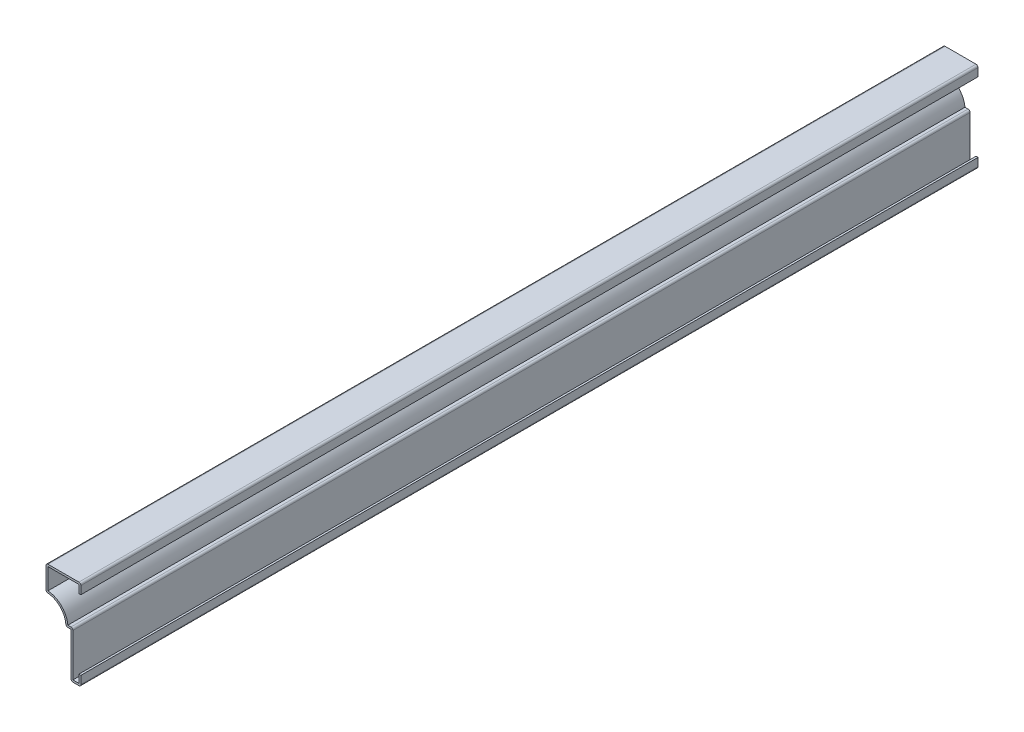
ISO-10303-21;
HEADER;
FILE_DESCRIPTION(('STEP AP214'),'2;1');
FILE_NAME('part.step','',(''),(''),'','','');
FILE_SCHEMA(('AUTOMOTIVE_DESIGN { 1 0 10303 214 1 1 1 1 }'));
ENDSEC;
DATA;
#1=APPLICATION_CONTEXT('core data for automotive mechanical design processes');
#2=APPLICATION_PROTOCOL_DEFINITION('international standard','automotive_design',2000,#1);
#3=PRODUCT_CONTEXT('',#1,'mechanical');
#4=PRODUCT('Part','Part','',(#3));
#5=PRODUCT_RELATED_PRODUCT_CATEGORY('part','',(#4));
#6=PRODUCT_DEFINITION_FORMATION('','',#4);
#7=PRODUCT_DEFINITION_CONTEXT('part definition',#1,'design');
#8=PRODUCT_DEFINITION('design','',#6,#7);
#9=PRODUCT_DEFINITION_SHAPE('','',#8);
#10=(LENGTH_UNIT() NAMED_UNIT(*) SI_UNIT(.MILLI.,.METRE.));
#11=(NAMED_UNIT(*) PLANE_ANGLE_UNIT() SI_UNIT($,.RADIAN.));
#12=(NAMED_UNIT(*) SI_UNIT($,.STERADIAN.) SOLID_ANGLE_UNIT());
#13=UNCERTAINTY_MEASURE_WITH_UNIT(LENGTH_MEASURE(1.E-05),#10,'distance_accuracy_value','');
#14=(GEOMETRIC_REPRESENTATION_CONTEXT(3) GLOBAL_UNCERTAINTY_ASSIGNED_CONTEXT((#13)) GLOBAL_UNIT_ASSIGNED_CONTEXT((#10,
#11,#12)) REPRESENTATION_CONTEXT('',''));
#15=CARTESIAN_POINT('',(0.,0.,0.));
#16=DIRECTION('',(0.,0.,1.));
#17=DIRECTION('',(1.,0.,0.));
#18=AXIS2_PLACEMENT_3D('',#15,#16,#17);
#19=CARTESIAN_POINT('',(-1.27,57.15,-571.5));
#20=DIRECTION('',(-1.,0.,0.));
#21=DIRECTION('',(0.,-1.,0.));
#22=AXIS2_PLACEMENT_3D('',#19,#20,#21);
#23=PLANE('',#22);
#24=DIRECTION('',(0.,-1.,0.));
#25=VECTOR('',#24,1.);
#26=CARTESIAN_POINT('',(-1.27,57.15,0.));
#27=LINE('',#26,#25);
#28=CARTESIAN_POINT('',(-1.27,55.88,0.));
#29=VERTEX_POINT('',#28);
#30=CARTESIAN_POINT('',(-1.27,50.8,0.));
#31=VERTEX_POINT('',#30);
#32=EDGE_CURVE('E273',#29,#31,#27,.T.);
#33=ORIENTED_EDGE('',*,*,#32,.F.);
#34=DIRECTION('',(0.,0.,1.));
#35=VECTOR('',#34,1.);
#36=CARTESIAN_POINT('',(-1.27,55.88,-571.5));
#37=LINE('',#36,#35);
#38=CARTESIAN_POINT('',(-1.27,55.88,-571.5));
#39=VERTEX_POINT('',#38);
#40=EDGE_CURVE('E227',#39,#29,#37,.T.);
#41=ORIENTED_EDGE('',*,*,#40,.F.);
#42=DIRECTION('',(0.,-1.,0.));
#43=VECTOR('',#42,1.);
#44=CARTESIAN_POINT('',(-1.27,57.15,-571.5));
#45=LINE('',#44,#43);
#46=CARTESIAN_POINT('',(-1.27,50.8,-571.5));
#47=VERTEX_POINT('',#46);
#48=EDGE_CURVE('E209',#39,#47,#45,.T.);
#49=ORIENTED_EDGE('',*,*,#48,.T.);
#50=DIRECTION('',(0.,0.,1.));
#51=VECTOR('',#50,1.);
#52=CARTESIAN_POINT('',(-1.27,50.8,-571.5));
#53=LINE('',#52,#51);
#54=EDGE_CURVE('E217',#47,#31,#53,.T.);
#55=ORIENTED_EDGE('',*,*,#54,.T.);
#56=EDGE_LOOP('',(#33,#41,#49,#55));
#57=FACE_BOUND('',#56,.T.);
#58=ADVANCED_FACE('F35',(#57),#23,.T.);
#59=CARTESIAN_POINT('',(-22.225,55.88,-571.5));
#60=DIRECTION('',(0.,-1.,0.));
#61=DIRECTION('',(0.,0.,-1.));
#62=AXIS2_PLACEMENT_3D('',#59,#60,#61);
#63=PLANE('',#62);
#64=DIRECTION('',(1.,0.,0.));
#65=VECTOR('',#64,1.);
#66=CARTESIAN_POINT('',(-22.225,55.88,0.));
#67=LINE('',#66,#65);
#68=CARTESIAN_POINT('',(-20.955,55.88,0.));
#69=VERTEX_POINT('',#68);
#70=EDGE_CURVE('E228',#69,#29,#67,.T.);
#71=ORIENTED_EDGE('',*,*,#70,.F.);
#72=DIRECTION('',(0.,0.,1.));
#73=VECTOR('',#72,1.);
#74=CARTESIAN_POINT('',(-20.955,55.88,-571.5));
#75=LINE('',#74,#73);
#76=CARTESIAN_POINT('',(-20.955,55.88,-571.5));
#77=VERTEX_POINT('',#76);
#78=EDGE_CURVE('E317',#77,#69,#75,.T.);
#79=ORIENTED_EDGE('',*,*,#78,.F.);
#80=DIRECTION('',(1.,0.,0.));
#81=VECTOR('',#80,1.);
#82=CARTESIAN_POINT('',(-22.225,55.88,-571.5));
#83=LINE('',#82,#81);
#84=EDGE_CURVE('E225',#77,#39,#83,.T.);
#85=ORIENTED_EDGE('',*,*,#84,.T.);
#86=ORIENTED_EDGE('',*,*,#40,.T.);
#87=EDGE_LOOP('',(#71,#79,#85,#86));
#88=FACE_BOUND('',#87,.T.);
#89=ADVANCED_FACE('F408',(#88),#63,.T.);
#90=CARTESIAN_POINT('',(-20.955,41.275,-571.5));
#91=DIRECTION('',(1.,0.,0.));
#92=DIRECTION('',(0.,0.,-1.));
#93=AXIS2_PLACEMENT_3D('',#90,#91,#92);
#94=PLANE('',#93);
#95=DIRECTION('',(0.,1.,0.));
#96=VECTOR('',#95,1.);
#97=CARTESIAN_POINT('',(-20.955,41.275,0.));
#98=LINE('',#97,#96);
#99=CARTESIAN_POINT('',(-20.955,42.4871529606312,0.));
#100=VERTEX_POINT('',#99);
#101=EDGE_CURVE('E231',#100,#69,#98,.T.);
#102=ORIENTED_EDGE('',*,*,#101,.F.);
#103=DIRECTION('',(0.,0.,1.));
#104=VECTOR('',#103,1.);
#105=CARTESIAN_POINT('',(-20.955,42.4871529606312,-571.5));
#106=LINE('',#105,#104);
#107=CARTESIAN_POINT('',(-20.955,42.4871529606312,-571.5));
#108=VERTEX_POINT('',#107);
#109=EDGE_CURVE('E319',#108,#100,#106,.T.);
#110=ORIENTED_EDGE('',*,*,#109,.F.);
#111=DIRECTION('',(0.,1.,0.));
#112=VECTOR('',#111,1.);
#113=CARTESIAN_POINT('',(-20.955,41.275,-571.5));
#114=LINE('',#113,#112);
#115=EDGE_CURVE('E269',#108,#77,#114,.T.);
#116=ORIENTED_EDGE('',*,*,#115,.T.);
#117=ORIENTED_EDGE('',*,*,#78,.T.);
#118=EDGE_LOOP('',(#102,#110,#116,#117));
#119=FACE_BOUND('',#118,.T.);
#120=ADVANCED_FACE('F496',(#119),#94,.T.);
#121=CARTESIAN_POINT('',(-22.225,28.575,-571.5));
#122=DIRECTION('',(0.,0.,1.));
#123=DIRECTION('',(1.,0.,0.));
#124=AXIS2_PLACEMENT_3D('',#121,#122,#123);
#125=CYLINDRICAL_SURFACE('',#124,13.97);
#126=CARTESIAN_POINT('',(-22.225,28.575,0.));
#127=DIRECTION('',(0.,0.,1.));
#128=DIRECTION('',(1.,0.,0.));
#129=AXIS2_PLACEMENT_3D('',#126,#127,#128);
#130=CIRCLE('',#129,13.97);
#131=CARTESIAN_POINT('',(-8.31284703936878,29.845,0.));
#132=VERTEX_POINT('',#131);
#133=EDGE_CURVE('E310',#132,#100,#130,.T.);
#134=ORIENTED_EDGE('',*,*,#133,.F.);
#135=DIRECTION('',(0.,0.,1.));
#136=VECTOR('',#135,1.);
#137=CARTESIAN_POINT('',(-8.31284703936878,29.845,-571.5));
#138=LINE('',#137,#136);
#139=CARTESIAN_POINT('',(-8.31284703936878,29.845,-571.5));
#140=VERTEX_POINT('',#139);
#141=EDGE_CURVE('E321',#140,#132,#138,.T.);
#142=ORIENTED_EDGE('',*,*,#141,.F.);
#143=CARTESIAN_POINT('',(-22.225,28.575,-571.5));
#144=DIRECTION('',(0.,0.,1.));
#145=DIRECTION('',(1.,0.,0.));
#146=AXIS2_PLACEMENT_3D('',#143,#144,#145);
#147=CIRCLE('',#146,13.97);
#148=EDGE_CURVE('E266',#140,#108,#147,.T.);
#149=ORIENTED_EDGE('',*,*,#148,.T.);
#150=ORIENTED_EDGE('',*,*,#109,.T.);
#151=EDGE_LOOP('',(#134,#142,#149,#150));
#152=FACE_BOUND('',#151,.T.);
#153=ADVANCED_FACE('F416',(#152),#125,.T.);
#154=CARTESIAN_POINT('',(-6.35,29.845,-571.5));
#155=DIRECTION('',(0.,1.,0.));
#156=DIRECTION('',(0.,0.,1.));
#157=AXIS2_PLACEMENT_3D('',#154,#155,#156);
#158=PLANE('',#157);
#159=DIRECTION('',(1.,0.,0.));
#160=VECTOR('',#159,1.);
#161=CARTESIAN_POINT('',(-6.35,29.845,0.));
#162=LINE('',#161,#160);
#163=CARTESIAN_POINT('',(-6.35,29.845,0.));
#164=VERTEX_POINT('',#163);
#165=EDGE_CURVE('E308',#164,#132,#162,.F.);
#166=ORIENTED_EDGE('',*,*,#165,.F.);
#167=DIRECTION('',(0.,0.,1.));
#168=VECTOR('',#167,1.);
#169=CARTESIAN_POINT('',(-6.35,29.845,-571.5));
#170=LINE('',#169,#168);
#171=CARTESIAN_POINT('',(-6.35,29.845,-571.5));
#172=VERTEX_POINT('',#171);
#173=EDGE_CURVE('E376',#164,#172,#170,.F.);
#174=ORIENTED_EDGE('',*,*,#173,.T.);
#175=DIRECTION('',(1.,0.,0.));
#176=VECTOR('',#175,1.);
#177=CARTESIAN_POINT('',(-6.35,29.845,-571.5));
#178=LINE('',#177,#176);
#179=EDGE_CURVE('E264',#172,#140,#178,.F.);
#180=ORIENTED_EDGE('',*,*,#179,.T.);
#181=ORIENTED_EDGE('',*,*,#141,.T.);
#182=EDGE_LOOP('',(#166,#174,#180,#181));
#183=FACE_BOUND('',#182,.T.);
#184=ADVANCED_FACE('F419',(#183),#158,.T.);
#185=CARTESIAN_POINT('',(-5.08,0.,-571.5));
#186=DIRECTION('',(1.,0.,0.));
#187=DIRECTION('',(0.,0.,-1.));
#188=AXIS2_PLACEMENT_3D('',#185,#186,#187);
#189=PLANE('',#188);
#190=DIRECTION('',(0.,1.,0.));
#191=VECTOR('',#190,1.);
#192=CARTESIAN_POINT('',(-5.08,0.,-571.5));
#193=LINE('',#192,#191);
#194=CARTESIAN_POINT('',(-5.08,1.27,-571.5));
#195=VERTEX_POINT('',#194);
#196=CARTESIAN_POINT('',(-5.08,28.575,-571.5));
#197=VERTEX_POINT('',#196);
#198=EDGE_CURVE('E261',#195,#197,#193,.T.);
#199=ORIENTED_EDGE('',*,*,#198,.T.);
#200=DIRECTION('',(0.,0.,1.));
#201=VECTOR('',#200,1.);
#202=CARTESIAN_POINT('',(-5.08,28.575,-571.5));
#203=LINE('',#202,#201);
#204=CARTESIAN_POINT('',(-5.08,28.575,0.));
#205=VERTEX_POINT('',#204);
#206=EDGE_CURVE('E373',#197,#205,#203,.T.);
#207=ORIENTED_EDGE('',*,*,#206,.T.);
#208=DIRECTION('',(0.,1.,0.));
#209=VECTOR('',#208,1.);
#210=CARTESIAN_POINT('',(-5.08,0.,0.));
#211=LINE('',#210,#209);
#212=CARTESIAN_POINT('',(-5.08,1.27,0.));
#213=VERTEX_POINT('',#212);
#214=EDGE_CURVE('E305',#213,#205,#211,.T.);
#215=ORIENTED_EDGE('',*,*,#214,.F.);
#216=DIRECTION('',(0.,0.,1.));
#217=VECTOR('',#216,1.);
#218=CARTESIAN_POINT('',(-5.08,1.27,-571.5));
#219=LINE('',#218,#217);
#220=EDGE_CURVE('E324',#195,#213,#219,.T.);
#221=ORIENTED_EDGE('',*,*,#220,.F.);
#222=EDGE_LOOP('',(#199,#207,#215,#221));
#223=FACE_BOUND('',#222,.T.);
#224=ADVANCED_FACE('F428',(#223),#189,.T.);
#225=CARTESIAN_POINT('',(0.,1.27,-571.5));
#226=DIRECTION('',(0.,1.,0.));
#227=DIRECTION('',(-1.,0.,0.));
#228=AXIS2_PLACEMENT_3D('',#225,#226,#227);
#229=PLANE('',#228);
#230=DIRECTION('',(-1.,0.,0.));
#231=VECTOR('',#230,1.);
#232=CARTESIAN_POINT('',(0.,1.27,0.));
#233=LINE('',#232,#231);
#234=CARTESIAN_POINT('',(-1.27,1.27,0.));
#235=VERTEX_POINT('',#234);
#236=EDGE_CURVE('E302',#235,#213,#233,.T.);
#237=ORIENTED_EDGE('',*,*,#236,.F.);
#238=DIRECTION('',(0.,0.,1.));
#239=VECTOR('',#238,1.);
#240=CARTESIAN_POINT('',(-1.27,1.27,-571.5));
#241=LINE('',#240,#239);
#242=CARTESIAN_POINT('',(-1.27,1.27,-571.5));
#243=VERTEX_POINT('',#242);
#244=EDGE_CURVE('E326',#243,#235,#241,.T.);
#245=ORIENTED_EDGE('',*,*,#244,.F.);
#246=DIRECTION('',(-1.,0.,0.));
#247=VECTOR('',#246,1.);
#248=CARTESIAN_POINT('',(0.,1.27,-571.5));
#249=LINE('',#248,#247);
#250=EDGE_CURVE('E258',#243,#195,#249,.T.);
#251=ORIENTED_EDGE('',*,*,#250,.T.);
#252=ORIENTED_EDGE('',*,*,#220,.T.);
#253=EDGE_LOOP('',(#237,#245,#251,#252));
#254=FACE_BOUND('',#253,.T.);
#255=ADVANCED_FACE('F433',(#254),#229,.T.);
#256=CARTESIAN_POINT('',(-1.27,6.35,-571.5));
#257=DIRECTION('',(-1.,0.,0.));
#258=DIRECTION('',(0.,0.,1.));
#259=AXIS2_PLACEMENT_3D('',#256,#257,#258);
#260=PLANE('',#259);
#261=DIRECTION('',(0.,1.,0.));
#262=VECTOR('',#261,1.);
#263=CARTESIAN_POINT('',(-1.27,6.35,0.));
#264=LINE('',#263,#262);
#265=CARTESIAN_POINT('',(-1.27,6.35,0.));
#266=VERTEX_POINT('',#265);
#267=EDGE_CURVE('E299',#266,#235,#264,.F.);
#268=ORIENTED_EDGE('',*,*,#267,.F.);
#269=DIRECTION('',(0.,0.,1.));
#270=VECTOR('',#269,1.);
#271=CARTESIAN_POINT('',(-1.27,6.35,-571.5));
#272=LINE('',#271,#270);
#273=CARTESIAN_POINT('',(-1.27,6.35,-571.5));
#274=VERTEX_POINT('',#273);
#275=EDGE_CURVE('E328',#274,#266,#272,.T.);
#276=ORIENTED_EDGE('',*,*,#275,.F.);
#277=DIRECTION('',(0.,1.,0.));
#278=VECTOR('',#277,1.);
#279=CARTESIAN_POINT('',(-1.27,6.35,-571.5));
#280=LINE('',#279,#278);
#281=EDGE_CURVE('E255',#274,#243,#280,.F.);
#282=ORIENTED_EDGE('',*,*,#281,.T.);
#283=ORIENTED_EDGE('',*,*,#244,.T.);
#284=EDGE_LOOP('',(#268,#276,#282,#283));
#285=FACE_BOUND('',#284,.T.);
#286=ADVANCED_FACE('F437',(#285),#260,.T.);
#287=CARTESIAN_POINT('',(-1.27,6.35,-571.5));
#288=DIRECTION('',(0.,-1.,0.));
#289=DIRECTION('',(0.,0.,-1.));
#290=AXIS2_PLACEMENT_3D('',#287,#288,#289);
#291=PLANE('',#290);
#292=DIRECTION('',(1.,0.,0.));
#293=VECTOR('',#292,1.);
#294=CARTESIAN_POINT('',(-1.27,6.35,0.));
#295=LINE('',#294,#293);
#296=CARTESIAN_POINT('',(0.,6.35,0.));
#297=VERTEX_POINT('',#296);
#298=EDGE_CURVE('E297',#266,#297,#295,.T.);
#299=ORIENTED_EDGE('',*,*,#298,.T.);
#300=DIRECTION('',(0.,0.,1.));
#301=VECTOR('',#300,1.);
#302=CARTESIAN_POINT('',(0.,6.35,-571.5));
#303=LINE('',#302,#301);
#304=CARTESIAN_POINT('',(0.,6.35,-571.5));
#305=VERTEX_POINT('',#304);
#306=EDGE_CURVE('E330',#305,#297,#303,.T.);
#307=ORIENTED_EDGE('',*,*,#306,.F.);
#308=DIRECTION('',(1.,0.,0.));
#309=VECTOR('',#308,1.);
#310=CARTESIAN_POINT('',(-1.27,6.35,-571.5));
#311=LINE('',#310,#309);
#312=EDGE_CURVE('E253',#274,#305,#311,.T.);
#313=ORIENTED_EDGE('',*,*,#312,.F.);
#314=ORIENTED_EDGE('',*,*,#275,.T.);
#315=EDGE_LOOP('',(#299,#307,#313,#314));
#316=FACE_BOUND('',#315,.T.);
#317=ADVANCED_FACE('F441',(#316),#291,.F.);
#318=CARTESIAN_POINT('',(0.,6.35,-571.5));
#319=DIRECTION('',(-1.,0.,0.));
#320=DIRECTION('',(0.,0.,1.));
#321=AXIS2_PLACEMENT_3D('',#318,#319,#320);
#322=PLANE('',#321);
#323=DIRECTION('',(0.,-1.,0.));
#324=VECTOR('',#323,1.);
#325=CARTESIAN_POINT('',(0.,6.35,0.));
#326=LINE('',#325,#324);
#327=CARTESIAN_POINT('',(0.,1.27,0.));
#328=VERTEX_POINT('',#327);
#329=EDGE_CURVE('E294',#297,#328,#326,.T.);
#330=ORIENTED_EDGE('',*,*,#329,.T.);
#331=DIRECTION('',(0.,0.,1.));
#332=VECTOR('',#331,1.);
#333=CARTESIAN_POINT('',(0.,1.27,-571.5));
#334=LINE('',#333,#332);
#335=CARTESIAN_POINT('',(0.,1.27,-571.5));
#336=VERTEX_POINT('',#335);
#337=EDGE_CURVE('E355',#328,#336,#334,.F.);
#338=ORIENTED_EDGE('',*,*,#337,.T.);
#339=DIRECTION('',(0.,-1.,0.));
#340=VECTOR('',#339,1.);
#341=CARTESIAN_POINT('',(0.,6.35,-571.5));
#342=LINE('',#341,#340);
#343=EDGE_CURVE('E251',#305,#336,#342,.T.);
#344=ORIENTED_EDGE('',*,*,#343,.F.);
#345=ORIENTED_EDGE('',*,*,#306,.T.);
#346=EDGE_LOOP('',(#330,#338,#344,#345));
#347=FACE_BOUND('',#346,.T.);
#348=ADVANCED_FACE('F617',(#347),#322,.F.);
#349=CARTESIAN_POINT('',(0.,0.,-571.5));
#350=DIRECTION('',(0.,1.,0.));
#351=DIRECTION('',(-1.,0.,0.));
#352=AXIS2_PLACEMENT_3D('',#349,#350,#351);
#353=PLANE('',#352);
#354=DIRECTION('',(-1.,0.,0.));
#355=VECTOR('',#354,1.);
#356=CARTESIAN_POINT('',(0.,0.,-571.5));
#357=LINE('',#356,#355);
#358=CARTESIAN_POINT('',(-1.27,0.,-571.5));
#359=VERTEX_POINT('',#358);
#360=CARTESIAN_POINT('',(-5.08,0.,-571.5));
#361=VERTEX_POINT('',#360);
#362=EDGE_CURVE('E248',#359,#361,#357,.T.);
#363=ORIENTED_EDGE('',*,*,#362,.F.);
#364=DIRECTION('',(0.,0.,1.));
#365=VECTOR('',#364,1.);
#366=CARTESIAN_POINT('',(-1.27,0.,-571.5));
#367=LINE('',#366,#365);
#368=CARTESIAN_POINT('',(-1.27,0.,0.));
#369=VERTEX_POINT('',#368);
#370=EDGE_CURVE('E338',#359,#369,#367,.T.);
#371=ORIENTED_EDGE('',*,*,#370,.T.);
#372=DIRECTION('',(-1.,0.,0.));
#373=VECTOR('',#372,1.);
#374=CARTESIAN_POINT('',(0.,0.,0.));
#375=LINE('',#374,#373);
#376=CARTESIAN_POINT('',(-5.08,0.,0.));
#377=VERTEX_POINT('',#376);
#378=EDGE_CURVE('E291',#369,#377,#375,.T.);
#379=ORIENTED_EDGE('',*,*,#378,.T.);
#380=DIRECTION('',(0.,0.,1.));
#381=VECTOR('',#380,1.);
#382=CARTESIAN_POINT('',(-5.08,0.,-571.5));
#383=LINE('',#382,#381);
#384=EDGE_CURVE('E316',#377,#361,#383,.F.);
#385=ORIENTED_EDGE('',*,*,#384,.T.);
#386=EDGE_LOOP('',(#363,#371,#379,#385));
#387=FACE_BOUND('',#386,.T.);
#388=ADVANCED_FACE('F451',(#387),#353,.F.);
#389=CARTESIAN_POINT('',(-6.35,0.,-571.5));
#390=DIRECTION('',(1.,0.,0.));
#391=DIRECTION('',(0.,0.,-1.));
#392=AXIS2_PLACEMENT_3D('',#389,#390,#391);
#393=PLANE('',#392);
#394=DIRECTION('',(0.,1.,0.));
#395=VECTOR('',#394,1.);
#396=CARTESIAN_POINT('',(-6.35,0.,-571.5));
#397=LINE('',#396,#395);
#398=CARTESIAN_POINT('',(-6.35,1.27,-571.5));
#399=VERTEX_POINT('',#398);
#400=CARTESIAN_POINT('',(-6.35,28.575,-571.5));
#401=VERTEX_POINT('',#400);
#402=EDGE_CURVE('E246',#399,#401,#397,.T.);
#403=ORIENTED_EDGE('',*,*,#402,.F.);
#404=DIRECTION('',(0.,0.,1.));
#405=VECTOR('',#404,1.);
#406=CARTESIAN_POINT('',(-6.35,1.27,-571.5));
#407=LINE('',#406,#405);
#408=CARTESIAN_POINT('',(-6.35,1.27,0.));
#409=VERTEX_POINT('',#408);
#410=EDGE_CURVE('E370',#399,#409,#407,.T.);
#411=ORIENTED_EDGE('',*,*,#410,.T.);
#412=DIRECTION('',(0.,1.,0.));
#413=VECTOR('',#412,1.);
#414=CARTESIAN_POINT('',(-6.35,0.,0.));
#415=LINE('',#414,#413);
#416=CARTESIAN_POINT('',(-6.35,28.575,0.));
#417=VERTEX_POINT('',#416);
#418=EDGE_CURVE('E289',#409,#417,#415,.T.);
#419=ORIENTED_EDGE('',*,*,#418,.T.);
#420=DIRECTION('',(0.,0.,1.));
#421=VECTOR('',#420,1.);
#422=CARTESIAN_POINT('',(-6.35,28.575,-571.5));
#423=LINE('',#422,#421);
#424=EDGE_CURVE('E333',#401,#417,#423,.T.);
#425=ORIENTED_EDGE('',*,*,#424,.F.);
#426=EDGE_LOOP('',(#403,#411,#419,#425));
#427=FACE_BOUND('',#426,.T.);
#428=ADVANCED_FACE('F462',(#427),#393,.F.);
#429=CARTESIAN_POINT('',(-6.35,28.575,-571.5));
#430=DIRECTION('',(0.,1.,0.));
#431=DIRECTION('',(0.,0.,1.));
#432=AXIS2_PLACEMENT_3D('',#429,#430,#431);
#433=PLANE('',#432);
#434=DIRECTION('',(-1.,0.,0.));
#435=VECTOR('',#434,1.);
#436=CARTESIAN_POINT('',(-6.35,28.575,0.));
#437=LINE('',#436,#435);
#438=CARTESIAN_POINT('',(-8.31284703936878,28.575,0.));
#439=VERTEX_POINT('',#438);
#440=EDGE_CURVE('E286',#417,#439,#437,.T.);
#441=ORIENTED_EDGE('',*,*,#440,.T.);
#442=DIRECTION('',(0.,0.,1.));
#443=VECTOR('',#442,1.);
#444=CARTESIAN_POINT('',(-8.31284703936878,28.575,-571.5));
#445=LINE('',#444,#443);
#446=CARTESIAN_POINT('',(-8.31284703936878,28.575,-571.5));
#447=VERTEX_POINT('',#446);
#448=EDGE_CURVE('E383',#439,#447,#445,.F.);
#449=ORIENTED_EDGE('',*,*,#448,.T.);
#450=DIRECTION('',(-1.,0.,0.));
#451=VECTOR('',#450,1.);
#452=CARTESIAN_POINT('',(-6.35,28.575,-571.5));
#453=LINE('',#452,#451);
#454=EDGE_CURVE('E243',#401,#447,#453,.T.);
#455=ORIENTED_EDGE('',*,*,#454,.F.);
#456=ORIENTED_EDGE('',*,*,#424,.T.);
#457=EDGE_LOOP('',(#441,#449,#455,#456));
#458=FACE_BOUND('',#457,.T.);
#459=ADVANCED_FACE('F595',(#458),#433,.F.);
#460=CARTESIAN_POINT('',(-22.225,28.575,-571.5));
#461=DIRECTION('',(0.,0.,1.));
#462=DIRECTION('',(1.,0.,0.));
#463=AXIS2_PLACEMENT_3D('',#460,#461,#462);
#464=CYLINDRICAL_SURFACE('',#463,12.7);
#465=CARTESIAN_POINT('',(-22.225,28.575,-571.5));
#466=DIRECTION('',(0.,0.,1.));
#467=DIRECTION('',(1.,0.,0.));
#468=AXIS2_PLACEMENT_3D('',#465,#466,#467);
#469=CIRCLE('',#468,12.7);
#470=CARTESIAN_POINT('',(-9.57758821760798,29.7295454545454,-571.5));
#471=VERTEX_POINT('',#470);
#472=CARTESIAN_POINT('',(-21.0704545454545,41.222411782392,-571.5));
#473=VERTEX_POINT('',#472);
#474=EDGE_CURVE('E240',#471,#473,#469,.T.);
#475=ORIENTED_EDGE('',*,*,#474,.F.);
#476=DIRECTION('',(0.,0.,1.));
#477=VECTOR('',#476,1.);
#478=CARTESIAN_POINT('',(-9.57758821760798,29.7295454545454,-571.5));
#479=LINE('',#478,#477);
#480=CARTESIAN_POINT('',(-9.57758821760798,29.7295454545454,0.));
#481=VERTEX_POINT('',#480);
#482=EDGE_CURVE('E380',#471,#481,#479,.T.);
#483=ORIENTED_EDGE('',*,*,#482,.T.);
#484=CARTESIAN_POINT('',(-22.225,28.575,0.));
#485=DIRECTION('',(0.,0.,1.));
#486=DIRECTION('',(1.,0.,0.));
#487=AXIS2_PLACEMENT_3D('',#484,#485,#486);
#488=CIRCLE('',#487,12.7);
#489=CARTESIAN_POINT('',(-21.0704545454545,41.222411782392,0.));
#490=VERTEX_POINT('',#489);
#491=EDGE_CURVE('E283',#481,#490,#488,.T.);
#492=ORIENTED_EDGE('',*,*,#491,.T.);
#493=DIRECTION('',(0.,0.,1.));
#494=VECTOR('',#493,1.);
#495=CARTESIAN_POINT('',(-21.0704545454545,41.222411782392,-571.5));
#496=LINE('',#495,#494);
#497=EDGE_CURVE('E378',#490,#473,#496,.F.);
#498=ORIENTED_EDGE('',*,*,#497,.T.);
#499=EDGE_LOOP('',(#475,#483,#492,#498));
#500=FACE_BOUND('',#499,.T.);
#501=ADVANCED_FACE('F474',(#500),#464,.F.);
#502=CARTESIAN_POINT('',(-22.225,41.275,-571.5));
#503=DIRECTION('',(1.,0.,0.));
#504=DIRECTION('',(0.,0.,-1.));
#505=AXIS2_PLACEMENT_3D('',#502,#503,#504);
#506=PLANE('',#505);
#507=DIRECTION('',(0.,1.,0.));
#508=VECTOR('',#507,1.);
#509=CARTESIAN_POINT('',(-22.225,41.275,-571.5));
#510=LINE('',#509,#508);
#511=CARTESIAN_POINT('',(-22.225,42.4871529606312,-571.5));
#512=VERTEX_POINT('',#511);
#513=CARTESIAN_POINT('',(-22.225,55.88,-571.5));
#514=VERTEX_POINT('',#513);
#515=EDGE_CURVE('E237',#512,#514,#510,.T.);
#516=ORIENTED_EDGE('',*,*,#515,.F.);
#517=DIRECTION('',(0.,0.,1.));
#518=VECTOR('',#517,1.);
#519=CARTESIAN_POINT('',(-22.225,42.4871529606312,-571.5));
#520=LINE('',#519,#518);
#521=CARTESIAN_POINT('',(-22.225,42.4871529606312,0.));
#522=VERTEX_POINT('',#521);
#523=EDGE_CURVE('E387',#512,#522,#520,.T.);
#524=ORIENTED_EDGE('',*,*,#523,.T.);
#525=DIRECTION('',(0.,1.,0.));
#526=VECTOR('',#525,1.);
#527=CARTESIAN_POINT('',(-22.225,41.275,0.));
#528=LINE('',#527,#526);
#529=CARTESIAN_POINT('',(-22.225,55.88,0.));
#530=VERTEX_POINT('',#529);
#531=EDGE_CURVE('E280',#522,#530,#528,.T.);
#532=ORIENTED_EDGE('',*,*,#531,.T.);
#533=DIRECTION('',(0.,0.,1.));
#534=VECTOR('',#533,1.);
#535=CARTESIAN_POINT('',(-22.225,55.88,-571.5));
#536=LINE('',#535,#534);
#537=EDGE_CURVE('E385',#530,#514,#536,.F.);
#538=ORIENTED_EDGE('',*,*,#537,.T.);
#539=EDGE_LOOP('',(#516,#524,#532,#538));
#540=FACE_BOUND('',#539,.T.);
#541=ADVANCED_FACE('F482',(#540),#506,.F.);
#542=CARTESIAN_POINT('',(-22.225,57.15,-571.5));
#543=DIRECTION('',(0.,-1.,0.));
#544=DIRECTION('',(0.,0.,-1.));
#545=AXIS2_PLACEMENT_3D('',#542,#543,#544);
#546=PLANE('',#545);
#547=DIRECTION('',(1.,0.,0.));
#548=VECTOR('',#547,1.);
#549=CARTESIAN_POINT('',(-22.225,57.15,-571.5));
#550=LINE('',#549,#548);
#551=CARTESIAN_POINT('',(-20.955,57.15,-571.5));
#552=VERTEX_POINT('',#551);
#553=CARTESIAN_POINT('',(-1.27,57.15,-571.5));
#554=VERTEX_POINT('',#553);
#555=EDGE_CURVE('E235',#552,#554,#550,.T.);
#556=ORIENTED_EDGE('',*,*,#555,.F.);
#557=DIRECTION('',(0.,0.,1.));
#558=VECTOR('',#557,1.);
#559=CARTESIAN_POINT('',(-20.955,57.15,-571.5));
#560=LINE('',#559,#558);
#561=CARTESIAN_POINT('',(-20.955,57.15,0.));
#562=VERTEX_POINT('',#561);
#563=EDGE_CURVE('E43',#552,#562,#560,.T.);
#564=ORIENTED_EDGE('',*,*,#563,.T.);
#565=DIRECTION('',(1.,0.,0.));
#566=VECTOR('',#565,1.);
#567=CARTESIAN_POINT('',(-22.225,57.15,0.));
#568=LINE('',#567,#566);
#569=CARTESIAN_POINT('',(-1.27,57.15,0.));
#570=VERTEX_POINT('',#569);
#571=EDGE_CURVE('E278',#562,#570,#568,.T.);
#572=ORIENTED_EDGE('',*,*,#571,.T.);
#573=DIRECTION('',(0.,0.,1.));
#574=VECTOR('',#573,1.);
#575=CARTESIAN_POINT('',(-1.27,57.15,-571.5));
#576=LINE('',#575,#574);
#577=EDGE_CURVE('E58',#570,#554,#576,.F.);
#578=ORIENTED_EDGE('',*,*,#577,.T.);
#579=EDGE_LOOP('',(#556,#564,#572,#578));
#580=FACE_BOUND('',#579,.T.);
#581=ADVANCED_FACE('F393',(#580),#546,.F.);
#582=CARTESIAN_POINT('',(0.,57.15,-571.5));
#583=DIRECTION('',(-1.,0.,0.));
#584=DIRECTION('',(0.,-1.,0.));
#585=AXIS2_PLACEMENT_3D('',#582,#583,#584);
#586=PLANE('',#585);
#587=DIRECTION('',(0.,-1.,0.));
#588=VECTOR('',#587,1.);
#589=CARTESIAN_POINT('',(0.,57.15,-571.5));
#590=LINE('',#589,#588);
#591=CARTESIAN_POINT('',(0.,55.88,-571.5));
#592=VERTEX_POINT('',#591);
#593=CARTESIAN_POINT('',(0.,50.8,-571.5));
#594=VERTEX_POINT('',#593);
#595=EDGE_CURVE('E211',#592,#594,#590,.T.);
#596=ORIENTED_EDGE('',*,*,#595,.F.);
#597=DIRECTION('',(0.,0.,1.));
#598=VECTOR('',#597,1.);
#599=CARTESIAN_POINT('',(0.,55.88,-571.5));
#600=LINE('',#599,#598);
#601=CARTESIAN_POINT('',(0.,55.88,0.));
#602=VERTEX_POINT('',#601);
#603=EDGE_CURVE('E11',#592,#602,#600,.T.);
#604=ORIENTED_EDGE('',*,*,#603,.T.);
#605=DIRECTION('',(0.,-1.,0.));
#606=VECTOR('',#605,1.);
#607=CARTESIAN_POINT('',(0.,57.15,0.));
#608=LINE('',#607,#606);
#609=CARTESIAN_POINT('',(0.,50.8,0.));
#610=VERTEX_POINT('',#609);
#611=EDGE_CURVE('E276',#602,#610,#608,.T.);
#612=ORIENTED_EDGE('',*,*,#611,.T.);
#613=DIRECTION('',(0.,0.,1.));
#614=VECTOR('',#613,1.);
#615=CARTESIAN_POINT('',(0.,50.8,-571.5));
#616=LINE('',#615,#614);
#617=EDGE_CURVE('E224',#594,#610,#616,.T.);
#618=ORIENTED_EDGE('',*,*,#617,.F.);
#619=EDGE_LOOP('',(#596,#604,#612,#618));
#620=FACE_BOUND('',#619,.T.);
#621=ADVANCED_FACE('F404',(#620),#586,.F.);
#622=CARTESIAN_POINT('',(0.,50.8,-571.5));
#623=DIRECTION('',(0.,1.,0.));
#624=DIRECTION('',(0.,0.,1.));
#625=AXIS2_PLACEMENT_3D('',#622,#623,#624);
#626=PLANE('',#625);
#627=DIRECTION('',(-1.,0.,0.));
#628=VECTOR('',#627,1.);
#629=CARTESIAN_POINT('',(0.,50.8,0.));
#630=LINE('',#629,#628);
#631=EDGE_CURVE('E220',#610,#31,#630,.T.);
#632=ORIENTED_EDGE('',*,*,#631,.T.);
#633=ORIENTED_EDGE('',*,*,#54,.F.);
#634=DIRECTION('',(-1.,0.,0.));
#635=VECTOR('',#634,1.);
#636=CARTESIAN_POINT('',(0.,50.8,-571.5));
#637=LINE('',#636,#635);
#638=EDGE_CURVE('E203',#594,#47,#637,.T.);
#639=ORIENTED_EDGE('',*,*,#638,.F.);
#640=ORIENTED_EDGE('',*,*,#617,.T.);
#641=EDGE_LOOP('',(#632,#633,#639,#640));
#642=FACE_BOUND('',#641,.T.);
#643=ADVANCED_FACE('F218',(#642),#626,.F.);
#644=CARTESIAN_POINT('',(-22.225,28.575,-571.5));
#645=DIRECTION('',(0.,0.,1.));
#646=DIRECTION('',(1.,0.,0.));
#647=AXIS2_PLACEMENT_3D('',#644,#645,#646);
#648=PLANE('',#647);
#649=ORIENTED_EDGE('',*,*,#343,.T.);
#650=CARTESIAN_POINT('',(-1.27,1.27,-571.5));
#651=DIRECTION('',(0.,0.,1.));
#652=DIRECTION('',(1.,0.,0.));
#653=AXIS2_PLACEMENT_3D('',#650,#651,#652);
#654=CIRCLE('',#653,1.27);
#655=EDGE_CURVE('E368',#336,#359,#654,.F.);
#656=ORIENTED_EDGE('',*,*,#655,.T.);
#657=ORIENTED_EDGE('',*,*,#362,.T.);
#658=CARTESIAN_POINT('',(-5.08,1.27,-571.5));
#659=DIRECTION('',(0.,0.,1.));
#660=DIRECTION('',(1.,0.,0.));
#661=AXIS2_PLACEMENT_3D('',#658,#659,#660);
#662=CIRCLE('',#661,1.27);
#663=EDGE_CURVE('E366',#361,#399,#662,.F.);
#664=ORIENTED_EDGE('',*,*,#663,.T.);
#665=ORIENTED_EDGE('',*,*,#402,.T.);
#666=ORIENTED_EDGE('',*,*,#454,.T.);
#667=CARTESIAN_POINT('',(-8.31284703936878,29.845,-571.5));
#668=DIRECTION('',(0.,0.,1.));
#669=DIRECTION('',(1.,0.,0.));
#670=AXIS2_PLACEMENT_3D('',#667,#668,#669);
#671=CIRCLE('',#670,1.27);
#672=EDGE_CURVE('E362',#447,#471,#671,.F.);
#673=ORIENTED_EDGE('',*,*,#672,.T.);
#674=ORIENTED_EDGE('',*,*,#474,.T.);
#675=CARTESIAN_POINT('',(-20.955,42.4871529606312,-571.5));
#676=DIRECTION('',(0.,0.,1.));
#677=DIRECTION('',(1.,0.,0.));
#678=AXIS2_PLACEMENT_3D('',#675,#676,#677);
#679=CIRCLE('',#678,1.27);
#680=EDGE_CURVE('E360',#473,#512,#679,.F.);
#681=ORIENTED_EDGE('',*,*,#680,.T.);
#682=ORIENTED_EDGE('',*,*,#515,.T.);
#683=CARTESIAN_POINT('',(-20.955,55.88,-571.5));
#684=DIRECTION('',(0.,0.,1.));
#685=DIRECTION('',(1.,0.,0.));
#686=AXIS2_PLACEMENT_3D('',#683,#684,#685);
#687=CIRCLE('',#686,1.27);
#688=EDGE_CURVE('E358',#514,#552,#687,.F.);
#689=ORIENTED_EDGE('',*,*,#688,.T.);
#690=ORIENTED_EDGE('',*,*,#555,.T.);
#691=CARTESIAN_POINT('',(-1.27,55.88,-571.5));
#692=DIRECTION('',(0.,0.,1.));
#693=DIRECTION('',(1.,0.,0.));
#694=AXIS2_PLACEMENT_3D('',#691,#692,#693);
#695=CIRCLE('',#694,1.27);
#696=EDGE_CURVE('E50',#554,#592,#695,.F.);
#697=ORIENTED_EDGE('',*,*,#696,.T.);
#698=ORIENTED_EDGE('',*,*,#595,.T.);
#699=ORIENTED_EDGE('',*,*,#638,.T.);
#700=ORIENTED_EDGE('',*,*,#48,.F.);
#701=ORIENTED_EDGE('',*,*,#84,.F.);
#702=ORIENTED_EDGE('',*,*,#115,.F.);
#703=ORIENTED_EDGE('',*,*,#148,.F.);
#704=ORIENTED_EDGE('',*,*,#179,.F.);
#705=CARTESIAN_POINT('',(-6.35,28.575,-571.5));
#706=DIRECTION('',(0.,0.,1.));
#707=DIRECTION('',(1.,0.,0.));
#708=AXIS2_PLACEMENT_3D('',#705,#706,#707);
#709=CIRCLE('',#708,1.27);
#710=EDGE_CURVE('E364',#172,#197,#709,.F.);
#711=ORIENTED_EDGE('',*,*,#710,.T.);
#712=ORIENTED_EDGE('',*,*,#198,.F.);
#713=ORIENTED_EDGE('',*,*,#250,.F.);
#714=ORIENTED_EDGE('',*,*,#281,.F.);
#715=ORIENTED_EDGE('',*,*,#312,.T.);
#716=EDGE_LOOP('',(#649,#656,#657,#664,#665,#666,#673,#674,#681,#682,#689,#690,#697,#698,#699,
#700,#701,#702,#703,#704,#711,#712,#713,#714,#715));
#717=FACE_BOUND('',#716,.T.);
#718=ADVANCED_FACE('F206',(#717),#648,.F.);
#719=CARTESIAN_POINT('',(-22.225,28.575,0.));
#720=DIRECTION('',(0.,0.,1.));
#721=DIRECTION('',(1.,0.,0.));
#722=AXIS2_PLACEMENT_3D('',#719,#720,#721);
#723=PLANE('',#722);
#724=ORIENTED_EDGE('',*,*,#378,.F.);
#725=CARTESIAN_POINT('',(-1.27,1.27,0.));
#726=DIRECTION('',(0.,0.,1.));
#727=DIRECTION('',(1.,0.,0.));
#728=AXIS2_PLACEMENT_3D('',#725,#726,#727);
#729=CIRCLE('',#728,1.27);
#730=EDGE_CURVE('E353',#369,#328,#729,.T.);
#731=ORIENTED_EDGE('',*,*,#730,.T.);
#732=ORIENTED_EDGE('',*,*,#329,.F.);
#733=ORIENTED_EDGE('',*,*,#298,.F.);
#734=ORIENTED_EDGE('',*,*,#267,.T.);
#735=ORIENTED_EDGE('',*,*,#236,.T.);
#736=ORIENTED_EDGE('',*,*,#214,.T.);
#737=CARTESIAN_POINT('',(-6.35,28.575,0.));
#738=DIRECTION('',(0.,0.,1.));
#739=DIRECTION('',(1.,0.,0.));
#740=AXIS2_PLACEMENT_3D('',#737,#738,#739);
#741=CIRCLE('',#740,1.27);
#742=EDGE_CURVE('E349',#205,#164,#741,.T.);
#743=ORIENTED_EDGE('',*,*,#742,.T.);
#744=ORIENTED_EDGE('',*,*,#165,.T.);
#745=ORIENTED_EDGE('',*,*,#133,.T.);
#746=ORIENTED_EDGE('',*,*,#101,.T.);
#747=ORIENTED_EDGE('',*,*,#70,.T.);
#748=ORIENTED_EDGE('',*,*,#32,.T.);
#749=ORIENTED_EDGE('',*,*,#631,.F.);
#750=ORIENTED_EDGE('',*,*,#611,.F.);
#751=CARTESIAN_POINT('',(-1.27,55.88,0.));
#752=DIRECTION('',(0.,0.,1.));
#753=DIRECTION('',(1.,0.,0.));
#754=AXIS2_PLACEMENT_3D('',#751,#752,#753);
#755=CIRCLE('',#754,1.27);
#756=EDGE_CURVE('E341',#602,#570,#755,.T.);
#757=ORIENTED_EDGE('',*,*,#756,.T.);
#758=ORIENTED_EDGE('',*,*,#571,.F.);
#759=CARTESIAN_POINT('',(-20.955,55.88,0.));
#760=DIRECTION('',(0.,0.,1.));
#761=DIRECTION('',(1.,0.,0.));
#762=AXIS2_PLACEMENT_3D('',#759,#760,#761);
#763=CIRCLE('',#762,1.27);
#764=EDGE_CURVE('E343',#562,#530,#763,.T.);
#765=ORIENTED_EDGE('',*,*,#764,.T.);
#766=ORIENTED_EDGE('',*,*,#531,.F.);
#767=CARTESIAN_POINT('',(-20.955,42.4871529606312,0.));
#768=DIRECTION('',(0.,0.,1.));
#769=DIRECTION('',(1.,0.,0.));
#770=AXIS2_PLACEMENT_3D('',#767,#768,#769);
#771=CIRCLE('',#770,1.27);
#772=EDGE_CURVE('E345',#522,#490,#771,.T.);
#773=ORIENTED_EDGE('',*,*,#772,.T.);
#774=ORIENTED_EDGE('',*,*,#491,.F.);
#775=CARTESIAN_POINT('',(-8.31284703936878,29.845,0.));
#776=DIRECTION('',(0.,0.,1.));
#777=DIRECTION('',(1.,0.,0.));
#778=AXIS2_PLACEMENT_3D('',#775,#776,#777);
#779=CIRCLE('',#778,1.27);
#780=EDGE_CURVE('E347',#481,#439,#779,.T.);
#781=ORIENTED_EDGE('',*,*,#780,.T.);
#782=ORIENTED_EDGE('',*,*,#440,.F.);
#783=ORIENTED_EDGE('',*,*,#418,.F.);
#784=CARTESIAN_POINT('',(-5.08,1.27,0.));
#785=DIRECTION('',(0.,0.,1.));
#786=DIRECTION('',(1.,0.,0.));
#787=AXIS2_PLACEMENT_3D('',#784,#785,#786);
#788=CIRCLE('',#787,1.27);
#789=EDGE_CURVE('E351',#409,#377,#788,.T.);
#790=ORIENTED_EDGE('',*,*,#789,.T.);
#791=EDGE_LOOP('',(#724,#731,#732,#733,#734,#735,#736,#743,#744,#745,#746,#747,#748,#749,#750,
#757,#758,#765,#766,#773,#774,#781,#782,#783,#790));
#792=FACE_BOUND('',#791,.T.);
#793=ADVANCED_FACE('F398',(#792),#723,.T.);
#794=CARTESIAN_POINT('',(-1.27,1.27,-571.5));
#795=DIRECTION('',(0.,0.,1.));
#796=DIRECTION('',(1.,0.,0.));
#797=AXIS2_PLACEMENT_3D('',#794,#795,#796);
#798=CYLINDRICAL_SURFACE('',#797,1.27);
#799=ORIENTED_EDGE('',*,*,#655,.F.);
#800=ORIENTED_EDGE('',*,*,#337,.F.);
#801=ORIENTED_EDGE('',*,*,#730,.F.);
#802=ORIENTED_EDGE('',*,*,#370,.F.);
#803=EDGE_LOOP('',(#799,#800,#801,#802));
#804=FACE_BOUND('',#803,.T.);
#805=ADVANCED_FACE('F449',(#804),#798,.T.);
#806=CARTESIAN_POINT('',(-5.08,1.27,-571.5));
#807=DIRECTION('',(0.,0.,1.));
#808=DIRECTION('',(1.,0.,0.));
#809=AXIS2_PLACEMENT_3D('',#806,#807,#808);
#810=CYLINDRICAL_SURFACE('',#809,1.27);
#811=ORIENTED_EDGE('',*,*,#663,.F.);
#812=ORIENTED_EDGE('',*,*,#384,.F.);
#813=ORIENTED_EDGE('',*,*,#789,.F.);
#814=ORIENTED_EDGE('',*,*,#410,.F.);
#815=EDGE_LOOP('',(#811,#812,#813,#814));
#816=FACE_BOUND('',#815,.T.);
#817=ADVANCED_FACE('F459',(#816),#810,.T.);
#818=CARTESIAN_POINT('',(-6.35,28.575,-571.5));
#819=DIRECTION('',(0.,0.,1.));
#820=DIRECTION('',(1.,0.,0.));
#821=AXIS2_PLACEMENT_3D('',#818,#819,#820);
#822=CYLINDRICAL_SURFACE('',#821,1.27);
#823=ORIENTED_EDGE('',*,*,#710,.F.);
#824=ORIENTED_EDGE('',*,*,#173,.F.);
#825=ORIENTED_EDGE('',*,*,#742,.F.);
#826=ORIENTED_EDGE('',*,*,#206,.F.);
#827=EDGE_LOOP('',(#823,#824,#825,#826));
#828=FACE_BOUND('',#827,.T.);
#829=ADVANCED_FACE('F425',(#828),#822,.T.);
#830=CARTESIAN_POINT('',(-8.31284703936878,29.845,-571.5));
#831=DIRECTION('',(0.,0.,1.));
#832=DIRECTION('',(1.,0.,0.));
#833=AXIS2_PLACEMENT_3D('',#830,#831,#832);
#834=CYLINDRICAL_SURFACE('',#833,1.27);
#835=ORIENTED_EDGE('',*,*,#672,.F.);
#836=ORIENTED_EDGE('',*,*,#448,.F.);
#837=ORIENTED_EDGE('',*,*,#780,.F.);
#838=ORIENTED_EDGE('',*,*,#482,.F.);
#839=EDGE_LOOP('',(#835,#836,#837,#838));
#840=FACE_BOUND('',#839,.T.);
#841=ADVANCED_FACE('F471',(#840),#834,.T.);
#842=CARTESIAN_POINT('',(-20.955,42.4871529606312,-571.5));
#843=DIRECTION('',(0.,0.,1.));
#844=DIRECTION('',(1.,0.,0.));
#845=AXIS2_PLACEMENT_3D('',#842,#843,#844);
#846=CYLINDRICAL_SURFACE('',#845,1.27);
#847=ORIENTED_EDGE('',*,*,#680,.F.);
#848=ORIENTED_EDGE('',*,*,#497,.F.);
#849=ORIENTED_EDGE('',*,*,#772,.F.);
#850=ORIENTED_EDGE('',*,*,#523,.F.);
#851=EDGE_LOOP('',(#847,#848,#849,#850));
#852=FACE_BOUND('',#851,.T.);
#853=ADVANCED_FACE('F479',(#852),#846,.T.);
#854=CARTESIAN_POINT('',(-20.955,55.88,-571.5));
#855=DIRECTION('',(0.,0.,1.));
#856=DIRECTION('',(1.,0.,0.));
#857=AXIS2_PLACEMENT_3D('',#854,#855,#856);
#858=CYLINDRICAL_SURFACE('',#857,1.27);
#859=ORIENTED_EDGE('',*,*,#688,.F.);
#860=ORIENTED_EDGE('',*,*,#537,.F.);
#861=ORIENTED_EDGE('',*,*,#764,.F.);
#862=ORIENTED_EDGE('',*,*,#563,.F.);
#863=EDGE_LOOP('',(#859,#860,#861,#862));
#864=FACE_BOUND('',#863,.T.);
#865=ADVANCED_FACE('F484',(#864),#858,.T.);
#866=CARTESIAN_POINT('',(-1.27,55.88,-571.5));
#867=DIRECTION('',(0.,0.,1.));
#868=DIRECTION('',(1.,0.,0.));
#869=AXIS2_PLACEMENT_3D('',#866,#867,#868);
#870=CYLINDRICAL_SURFACE('',#869,1.27);
#871=ORIENTED_EDGE('',*,*,#696,.F.);
#872=ORIENTED_EDGE('',*,*,#577,.F.);
#873=ORIENTED_EDGE('',*,*,#756,.F.);
#874=ORIENTED_EDGE('',*,*,#603,.F.);
#875=EDGE_LOOP('',(#871,#872,#873,#874));
#876=FACE_BOUND('',#875,.T.);
#877=ADVANCED_FACE('F37',(#876),#870,.T.);
#878=CLOSED_SHELL('',(#58,#89,#120,#153,#184,#224,#255,#286,#317,#348,#388,#428,#459,#501,#541,
#581,#621,#643,#718,#793,#805,#817,#829,#841,#853,#865,#877));
#879=MANIFOLD_SOLID_BREP('B2',#878);
#880=ADVANCED_BREP_SHAPE_REPRESENTATION('',(#18,#879),#14);
#881=SHAPE_DEFINITION_REPRESENTATION(#9,#880);
ENDSEC;
END-ISO-10303-21;
